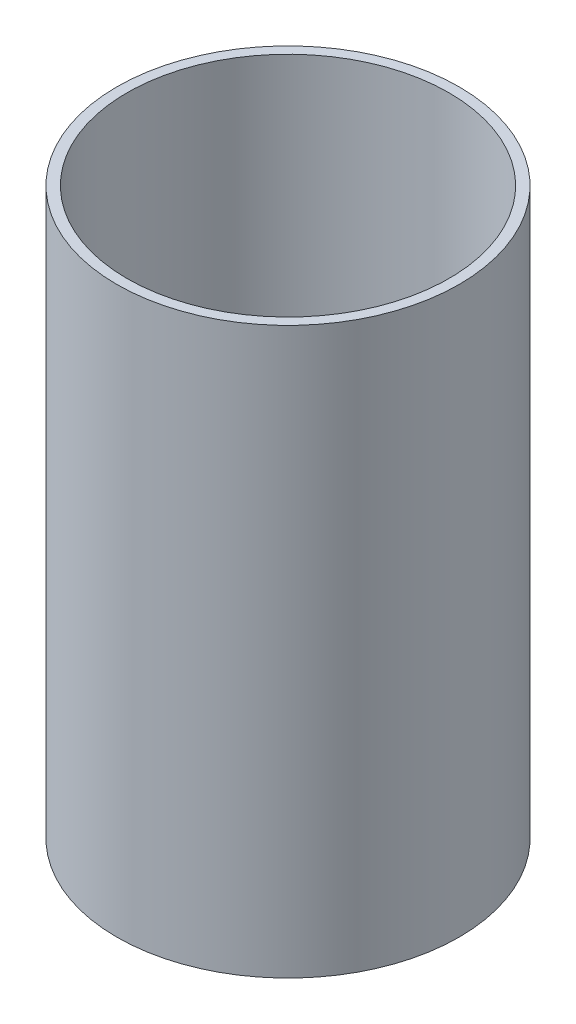
ISO-10303-21;
HEADER;
FILE_DESCRIPTION(('STEP AP214'),'2;1');
FILE_NAME('part.step','',(''),(''),'','','');
FILE_SCHEMA(('AUTOMOTIVE_DESIGN { 1 0 10303 214 1 1 1 1 }'));
ENDSEC;
DATA;
#1=APPLICATION_CONTEXT('core data for automotive mechanical design processes');
#2=APPLICATION_PROTOCOL_DEFINITION('international standard','automotive_design',2000,#1);
#3=PRODUCT_CONTEXT('',#1,'mechanical');
#4=PRODUCT('Part','Part','',(#3));
#5=PRODUCT_RELATED_PRODUCT_CATEGORY('part','',(#4));
#6=PRODUCT_DEFINITION_FORMATION('','',#4);
#7=PRODUCT_DEFINITION_CONTEXT('part definition',#1,'design');
#8=PRODUCT_DEFINITION('design','',#6,#7);
#9=PRODUCT_DEFINITION_SHAPE('','',#8);
#10=(LENGTH_UNIT() NAMED_UNIT(*) SI_UNIT(.MILLI.,.METRE.));
#11=(NAMED_UNIT(*) PLANE_ANGLE_UNIT() SI_UNIT($,.RADIAN.));
#12=(NAMED_UNIT(*) SI_UNIT($,.STERADIAN.) SOLID_ANGLE_UNIT());
#13=UNCERTAINTY_MEASURE_WITH_UNIT(LENGTH_MEASURE(1.E-05),#10,'distance_accuracy_value','');
#14=(GEOMETRIC_REPRESENTATION_CONTEXT(3) GLOBAL_UNCERTAINTY_ASSIGNED_CONTEXT((#13)) GLOBAL_UNIT_ASSIGNED_CONTEXT((#10,
#11,#12)) REPRESENTATION_CONTEXT('',''));
#15=CARTESIAN_POINT('',(0.,0.,0.));
#16=DIRECTION('',(0.,0.,1.));
#17=DIRECTION('',(1.,0.,0.));
#18=AXIS2_PLACEMENT_3D('',#15,#16,#17);
#19=CARTESIAN_POINT('',(0.,83.14,0.));
#20=DIRECTION('',(0.,1.,0.));
#21=DIRECTION('',(0.,0.,1.));
#22=AXIS2_PLACEMENT_3D('',#19,#20,#21);
#23=PLANE('',#22);
#24=CARTESIAN_POINT('',(0.,83.14,0.));
#25=DIRECTION('',(0.,1.,0.));
#26=DIRECTION('',(0.,0.,1.));
#27=AXIS2_PLACEMENT_3D('',#24,#25,#26);
#28=CIRCLE('',#27,25.175);
#29=CARTESIAN_POINT('',(0.,83.14,25.175));
#30=VERTEX_POINT('',#29);
#31=EDGE_CURVE('E10',#30,#30,#28,.T.);
#32=ORIENTED_EDGE('',*,*,#31,.T.);
#33=EDGE_LOOP('',(#32));
#34=FACE_BOUND('',#33,.T.);
#35=CARTESIAN_POINT('',(0.,83.14,0.));
#36=DIRECTION('',(0.,1.,0.));
#37=DIRECTION('',(0.,0.,1.));
#38=AXIS2_PLACEMENT_3D('',#35,#36,#37);
#39=CIRCLE('',#38,23.675);
#40=CARTESIAN_POINT('',(0.,83.14,23.675));
#41=VERTEX_POINT('',#40);
#42=EDGE_CURVE('E50',#41,#41,#39,.T.);
#43=ORIENTED_EDGE('',*,*,#42,.F.);
#44=EDGE_LOOP('',(#43));
#45=FACE_BOUND('',#44,.T.);
#46=ADVANCED_FACE('F37',(#34,#45),#23,.T.);
#47=CARTESIAN_POINT('',(0.,0.,0.));
#48=DIRECTION('',(0.,1.,0.));
#49=DIRECTION('',(0.,0.,1.));
#50=AXIS2_PLACEMENT_3D('',#47,#48,#49);
#51=PLANE('',#50);
#52=CARTESIAN_POINT('',(0.,0.,0.));
#53=DIRECTION('',(0.,1.,0.));
#54=DIRECTION('',(0.,0.,1.));
#55=AXIS2_PLACEMENT_3D('',#52,#53,#54);
#56=CIRCLE('',#55,25.175);
#57=CARTESIAN_POINT('',(0.,0.,25.175));
#58=VERTEX_POINT('',#57);
#59=EDGE_CURVE('E41',#58,#58,#56,.T.);
#60=ORIENTED_EDGE('',*,*,#59,.F.);
#61=EDGE_LOOP('',(#60));
#62=FACE_BOUND('',#61,.T.);
#63=CARTESIAN_POINT('',(0.,0.,0.));
#64=DIRECTION('',(0.,1.,0.));
#65=DIRECTION('',(0.,0.,1.));
#66=AXIS2_PLACEMENT_3D('',#63,#64,#65);
#67=CIRCLE('',#66,23.675);
#68=CARTESIAN_POINT('',(0.,0.,23.675));
#69=VERTEX_POINT('',#68);
#70=EDGE_CURVE('E52',#69,#69,#67,.T.);
#71=ORIENTED_EDGE('',*,*,#70,.T.);
#72=EDGE_LOOP('',(#71));
#73=FACE_BOUND('',#72,.T.);
#74=ADVANCED_FACE('F64',(#62,#73),#51,.F.);
#75=CARTESIAN_POINT('',(0.,83.14,0.));
#76=DIRECTION('',(0.,-1.,0.));
#77=DIRECTION('',(0.,0.,-1.));
#78=AXIS2_PLACEMENT_3D('',#75,#76,#77);
#79=CYLINDRICAL_SURFACE('',#78,25.175);
#80=ORIENTED_EDGE('',*,*,#31,.F.);
#81=EDGE_LOOP('',(#80));
#82=FACE_BOUND('',#81,.T.);
#83=ORIENTED_EDGE('',*,*,#59,.T.);
#84=EDGE_LOOP('',(#83));
#85=FACE_BOUND('',#84,.T.);
#86=ADVANCED_FACE('F39',(#82,#85),#79,.T.);
#87=CARTESIAN_POINT('',(0.,83.14,0.));
#88=DIRECTION('',(0.,-1.,0.));
#89=DIRECTION('',(0.,0.,-1.));
#90=AXIS2_PLACEMENT_3D('',#87,#88,#89);
#91=CYLINDRICAL_SURFACE('',#90,23.675);
#92=ORIENTED_EDGE('',*,*,#42,.T.);
#93=EDGE_LOOP('',(#92));
#94=FACE_BOUND('',#93,.T.);
#95=ORIENTED_EDGE('',*,*,#70,.F.);
#96=EDGE_LOOP('',(#95));
#97=FACE_BOUND('',#96,.T.);
#98=ADVANCED_FACE('F60',(#94,#97),#91,.F.);
#99=CLOSED_SHELL('',(#46,#74,#86,#98));
#100=MANIFOLD_SOLID_BREP('B2',#99);
#101=ADVANCED_BREP_SHAPE_REPRESENTATION('',(#18,#100),#14);
#102=SHAPE_DEFINITION_REPRESENTATION(#9,#101);
ENDSEC;
END-ISO-10303-21;
